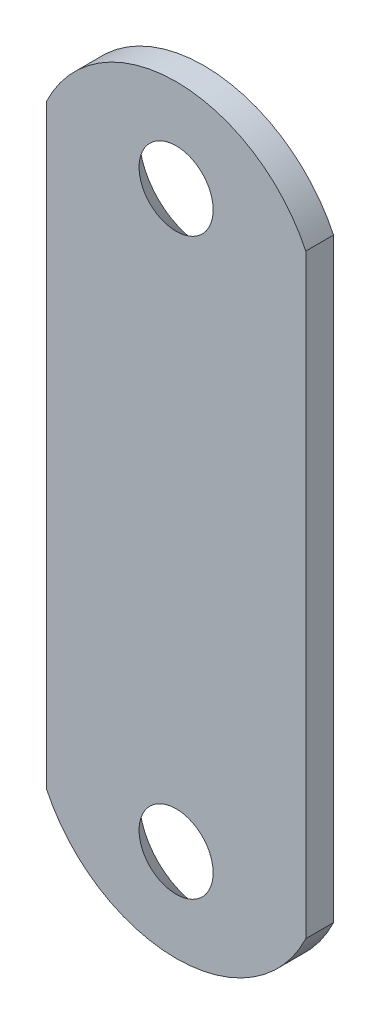
ISO-10303-21;
HEADER;
FILE_DESCRIPTION(('STEP AP214'),'2;1');
FILE_NAME('part.step','',(''),(''),'','','');
FILE_SCHEMA(('AUTOMOTIVE_DESIGN { 1 0 10303 214 1 1 1 1 }'));
ENDSEC;
DATA;
#1=APPLICATION_CONTEXT('core data for automotive mechanical design processes');
#2=APPLICATION_PROTOCOL_DEFINITION('international standard','automotive_design',2000,#1);
#3=PRODUCT_CONTEXT('',#1,'mechanical');
#4=PRODUCT('Part','Part','',(#3));
#5=PRODUCT_RELATED_PRODUCT_CATEGORY('part','',(#4));
#6=PRODUCT_DEFINITION_FORMATION('','',#4);
#7=PRODUCT_DEFINITION_CONTEXT('part definition',#1,'design');
#8=PRODUCT_DEFINITION('design','',#6,#7);
#9=PRODUCT_DEFINITION_SHAPE('','',#8);
#10=(LENGTH_UNIT() NAMED_UNIT(*) SI_UNIT(.MILLI.,.METRE.));
#11=(NAMED_UNIT(*) PLANE_ANGLE_UNIT() SI_UNIT($,.RADIAN.));
#12=(NAMED_UNIT(*) SI_UNIT($,.STERADIAN.) SOLID_ANGLE_UNIT());
#13=UNCERTAINTY_MEASURE_WITH_UNIT(LENGTH_MEASURE(1.E-05),#10,'distance_accuracy_value','');
#14=(GEOMETRIC_REPRESENTATION_CONTEXT(3) GLOBAL_UNCERTAINTY_ASSIGNED_CONTEXT((#13)) GLOBAL_UNIT_ASSIGNED_CONTEXT((#10,
#11,#12)) REPRESENTATION_CONTEXT('',''));
#15=CARTESIAN_POINT('',(0.,0.,0.));
#16=DIRECTION('',(0.,0.,1.));
#17=DIRECTION('',(1.,0.,0.));
#18=AXIS2_PLACEMENT_3D('',#15,#16,#17);
#19=CARTESIAN_POINT('',(0.,12.75,1.5));
#20=DIRECTION('',(0.,0.,1.));
#21=DIRECTION('',(1.,0.,0.));
#22=AXIS2_PLACEMENT_3D('',#19,#20,#21);
#23=PLANE('',#22);
#24=CARTESIAN_POINT('',(0.,-15.5,1.5));
#25=DIRECTION('',(0.,0.,1.));
#26=DIRECTION('',(1.,0.,0.));
#27=AXIS2_PLACEMENT_3D('',#24,#25,#26);
#28=CIRCLE('',#27,2.);
#29=CARTESIAN_POINT('',(2.,-15.5,1.5));
#30=VERTEX_POINT('',#29);
#31=EDGE_CURVE('E113',#30,#30,#28,.T.);
#32=ORIENTED_EDGE('',*,*,#31,.F.);
#33=EDGE_LOOP('',(#32));
#34=FACE_BOUND('',#33,.T.);
#35=CARTESIAN_POINT('',(0.,12.75,1.5));
#36=DIRECTION('',(0.,0.,1.));
#37=DIRECTION('',(1.,0.,0.));
#38=AXIS2_PLACEMENT_3D('',#35,#36,#37);
#39=CIRCLE('',#38,7.75);
#40=CARTESIAN_POINT('',(7.,16.0760336739125,1.5));
#41=VERTEX_POINT('',#40);
#42=CARTESIAN_POINT('',(-7.,16.0760336739125,1.5));
#43=VERTEX_POINT('',#42);
#44=EDGE_CURVE('E84',#41,#43,#39,.T.);
#45=ORIENTED_EDGE('',*,*,#44,.T.);
#46=DIRECTION('',(0.,-1.,0.));
#47=VECTOR('',#46,1.);
#48=CARTESIAN_POINT('',(-7.,16.0760336739125,1.5));
#49=LINE('',#48,#47);
#50=CARTESIAN_POINT('',(-7.,-16.0760336739125,1.5));
#51=VERTEX_POINT('',#50);
#52=EDGE_CURVE('E79',#43,#51,#49,.T.);
#53=ORIENTED_EDGE('',*,*,#52,.T.);
#54=CARTESIAN_POINT('',(0.,-12.75,1.5));
#55=DIRECTION('',(0.,0.,1.));
#56=DIRECTION('',(-1.,0.,0.));
#57=AXIS2_PLACEMENT_3D('',#54,#55,#56);
#58=CIRCLE('',#57,7.75);
#59=CARTESIAN_POINT('',(7.,-16.0760336739125,1.5));
#60=VERTEX_POINT('',#59);
#61=EDGE_CURVE('E82',#51,#60,#58,.T.);
#62=ORIENTED_EDGE('',*,*,#61,.T.);
#63=DIRECTION('',(0.,1.,0.));
#64=VECTOR('',#63,1.);
#65=CARTESIAN_POINT('',(7.,16.0760336739125,1.5));
#66=LINE('',#65,#64);
#67=EDGE_CURVE('E49',#60,#41,#66,.T.);
#68=ORIENTED_EDGE('',*,*,#67,.T.);
#69=EDGE_LOOP('',(#45,#53,#62,#68));
#70=FACE_BOUND('',#69,.T.);
#71=CARTESIAN_POINT('',(0.,15.5,1.5));
#72=DIRECTION('',(0.,0.,-1.));
#73=DIRECTION('',(1.,0.,0.));
#74=AXIS2_PLACEMENT_3D('',#71,#72,#73);
#75=CIRCLE('',#74,2.);
#76=CARTESIAN_POINT('',(2.,15.5,1.5));
#77=VERTEX_POINT('',#76);
#78=EDGE_CURVE('E119',#77,#77,#75,.T.);
#79=ORIENTED_EDGE('',*,*,#78,.T.);
#80=EDGE_LOOP('',(#79));
#81=FACE_BOUND('',#80,.T.);
#82=ADVANCED_FACE('F32',(#34,#70,#81),#23,.T.);
#83=CARTESIAN_POINT('',(0.,12.75,0.));
#84=DIRECTION('',(0.,0.,1.));
#85=DIRECTION('',(1.,0.,0.));
#86=AXIS2_PLACEMENT_3D('',#83,#84,#85);
#87=PLANE('',#86);
#88=CARTESIAN_POINT('',(0.,-15.5,0.));
#89=DIRECTION('',(0.,0.,1.));
#90=DIRECTION('',(1.,0.,0.));
#91=AXIS2_PLACEMENT_3D('',#88,#89,#90);
#92=CIRCLE('',#91,3.49999999999998);
#93=CARTESIAN_POINT('',(3.49999999999998,-15.5,0.));
#94=VERTEX_POINT('',#93);
#95=EDGE_CURVE('E99',#94,#94,#92,.T.);
#96=ORIENTED_EDGE('',*,*,#95,.T.);
#97=EDGE_LOOP('',(#96));
#98=FACE_BOUND('',#97,.T.);
#99=CARTESIAN_POINT('',(0.,12.75,0.));
#100=DIRECTION('',(0.,0.,1.));
#101=DIRECTION('',(1.,0.,0.));
#102=AXIS2_PLACEMENT_3D('',#99,#100,#101);
#103=CIRCLE('',#102,7.75);
#104=CARTESIAN_POINT('',(7.,16.0760336739125,0.));
#105=VERTEX_POINT('',#104);
#106=CARTESIAN_POINT('',(-7.,16.0760336739125,0.));
#107=VERTEX_POINT('',#106);
#108=EDGE_CURVE('E96',#105,#107,#103,.T.);
#109=ORIENTED_EDGE('',*,*,#108,.F.);
#110=DIRECTION('',(0.,1.,0.));
#111=VECTOR('',#110,1.);
#112=CARTESIAN_POINT('',(7.,16.0760336739125,0.));
#113=LINE('',#112,#111);
#114=CARTESIAN_POINT('',(7.,-16.0760336739125,0.));
#115=VERTEX_POINT('',#114);
#116=EDGE_CURVE('E72',#115,#105,#113,.T.);
#117=ORIENTED_EDGE('',*,*,#116,.F.);
#118=CARTESIAN_POINT('',(0.,-12.75,0.));
#119=DIRECTION('',(0.,0.,1.));
#120=DIRECTION('',(-1.,0.,0.));
#121=AXIS2_PLACEMENT_3D('',#118,#119,#120);
#122=CIRCLE('',#121,7.75);
#123=CARTESIAN_POINT('',(-7.,-16.0760336739125,0.));
#124=VERTEX_POINT('',#123);
#125=EDGE_CURVE('E66',#124,#115,#122,.T.);
#126=ORIENTED_EDGE('',*,*,#125,.F.);
#127=DIRECTION('',(0.,-1.,0.));
#128=VECTOR('',#127,1.);
#129=CARTESIAN_POINT('',(-7.,16.0760336739125,0.));
#130=LINE('',#129,#128);
#131=EDGE_CURVE('E88',#107,#124,#130,.T.);
#132=ORIENTED_EDGE('',*,*,#131,.F.);
#133=EDGE_LOOP('',(#109,#117,#126,#132));
#134=FACE_BOUND('',#133,.T.);
#135=CARTESIAN_POINT('',(0.,15.5,0.));
#136=DIRECTION('',(0.,0.,-1.));
#137=DIRECTION('',(1.,0.,0.));
#138=AXIS2_PLACEMENT_3D('',#135,#136,#137);
#139=CIRCLE('',#138,3.49999999999998);
#140=CARTESIAN_POINT('',(3.49999999999998,15.5,0.));
#141=VERTEX_POINT('',#140);
#142=EDGE_CURVE('E116',#141,#141,#139,.T.);
#143=ORIENTED_EDGE('',*,*,#142,.F.);
#144=EDGE_LOOP('',(#143));
#145=FACE_BOUND('',#144,.T.);
#146=ADVANCED_FACE('F107',(#98,#134,#145),#87,.F.);
#147=CARTESIAN_POINT('',(0.,12.75,1.5));
#148=DIRECTION('',(0.,0.,-1.));
#149=DIRECTION('',(-1.,0.,0.));
#150=AXIS2_PLACEMENT_3D('',#147,#148,#149);
#151=CYLINDRICAL_SURFACE('',#150,7.75);
#152=ORIENTED_EDGE('',*,*,#108,.T.);
#153=DIRECTION('',(0.,0.,-1.));
#154=VECTOR('',#153,1.);
#155=CARTESIAN_POINT('',(-7.,16.0760336739125,1.5));
#156=LINE('',#155,#154);
#157=EDGE_CURVE('E11',#43,#107,#156,.T.);
#158=ORIENTED_EDGE('',*,*,#157,.F.);
#159=ORIENTED_EDGE('',*,*,#44,.F.);
#160=DIRECTION('',(0.,0.,-1.));
#161=VECTOR('',#160,1.);
#162=CARTESIAN_POINT('',(7.,16.0760336739125,1.5));
#163=LINE('',#162,#161);
#164=EDGE_CURVE('E92',#41,#105,#163,.T.);
#165=ORIENTED_EDGE('',*,*,#164,.T.);
#166=EDGE_LOOP('',(#152,#158,#159,#165));
#167=FACE_BOUND('',#166,.T.);
#168=ADVANCED_FACE('F34',(#167),#151,.T.);
#169=CARTESIAN_POINT('',(-7.,16.0760336739125,1.5));
#170=DIRECTION('',(1.,0.,0.));
#171=DIRECTION('',(0.,0.,-1.));
#172=AXIS2_PLACEMENT_3D('',#169,#170,#171);
#173=PLANE('',#172);
#174=ORIENTED_EDGE('',*,*,#131,.T.);
#175=DIRECTION('',(0.,0.,-1.));
#176=VECTOR('',#175,1.);
#177=CARTESIAN_POINT('',(-7.,-16.0760336739125,1.5));
#178=LINE('',#177,#176);
#179=EDGE_CURVE('E41',#51,#124,#178,.T.);
#180=ORIENTED_EDGE('',*,*,#179,.F.);
#181=ORIENTED_EDGE('',*,*,#52,.F.);
#182=ORIENTED_EDGE('',*,*,#157,.T.);
#183=EDGE_LOOP('',(#174,#180,#181,#182));
#184=FACE_BOUND('',#183,.T.);
#185=ADVANCED_FACE('F87',(#184),#173,.F.);
#186=CARTESIAN_POINT('',(0.,-12.75,1.5));
#187=DIRECTION('',(0.,0.,-1.));
#188=DIRECTION('',(-1.,0.,0.));
#189=AXIS2_PLACEMENT_3D('',#186,#187,#188);
#190=CYLINDRICAL_SURFACE('',#189,7.75);
#191=ORIENTED_EDGE('',*,*,#125,.T.);
#192=DIRECTION('',(0.,0.,-1.));
#193=VECTOR('',#192,1.);
#194=CARTESIAN_POINT('',(7.,-16.0760336739125,1.5));
#195=LINE('',#194,#193);
#196=EDGE_CURVE('E89',#60,#115,#195,.T.);
#197=ORIENTED_EDGE('',*,*,#196,.F.);
#198=ORIENTED_EDGE('',*,*,#61,.F.);
#199=ORIENTED_EDGE('',*,*,#179,.T.);
#200=EDGE_LOOP('',(#191,#197,#198,#199));
#201=FACE_BOUND('',#200,.T.);
#202=ADVANCED_FACE('F90',(#201),#190,.T.);
#203=CARTESIAN_POINT('',(7.,16.0760336739125,1.5));
#204=DIRECTION('',(-1.,0.,0.));
#205=DIRECTION('',(0.,0.,1.));
#206=AXIS2_PLACEMENT_3D('',#203,#204,#205);
#207=PLANE('',#206);
#208=ORIENTED_EDGE('',*,*,#116,.T.);
#209=ORIENTED_EDGE('',*,*,#164,.F.);
#210=ORIENTED_EDGE('',*,*,#67,.F.);
#211=ORIENTED_EDGE('',*,*,#196,.T.);
#212=EDGE_LOOP('',(#208,#209,#210,#211));
#213=FACE_BOUND('',#212,.T.);
#214=ADVANCED_FACE('F104',(#213),#207,.F.);
#215=CARTESIAN_POINT('',(0.,-15.5,0.));
#216=DIRECTION('',(0.,0.,-1.));
#217=DIRECTION('',(-1.,0.,0.));
#218=AXIS2_PLACEMENT_3D('',#215,#216,#217);
#219=CONICAL_SURFACE('',#218,3.49999999999998,0.785398163397443);
#220=ORIENTED_EDGE('',*,*,#31,.T.);
#221=EDGE_LOOP('',(#220));
#222=FACE_BOUND('',#221,.T.);
#223=ORIENTED_EDGE('',*,*,#95,.F.);
#224=EDGE_LOOP('',(#223));
#225=FACE_BOUND('',#224,.T.);
#226=ADVANCED_FACE('F126',(#222,#225),#219,.F.);
#227=CARTESIAN_POINT('',(0.,15.5,0.));
#228=DIRECTION('',(0.,0.,-1.));
#229=DIRECTION('',(-1.,0.,0.));
#230=AXIS2_PLACEMENT_3D('',#227,#228,#229);
#231=CONICAL_SURFACE('',#230,3.49999999999998,0.785398163397443);
#232=ORIENTED_EDGE('',*,*,#78,.F.);
#233=EDGE_LOOP('',(#232));
#234=FACE_BOUND('',#233,.T.);
#235=ORIENTED_EDGE('',*,*,#142,.T.);
#236=EDGE_LOOP('',(#235));
#237=FACE_BOUND('',#236,.T.);
#238=ADVANCED_FACE('F123',(#234,#237),#231,.F.);
#239=CLOSED_SHELL('',(#82,#146,#168,#185,#202,#214,#226,#238));
#240=MANIFOLD_SOLID_BREP('B2',#239);
#241=ADVANCED_BREP_SHAPE_REPRESENTATION('',(#18,#240),#14);
#242=SHAPE_DEFINITION_REPRESENTATION(#9,#241);
ENDSEC;
END-ISO-10303-21;
